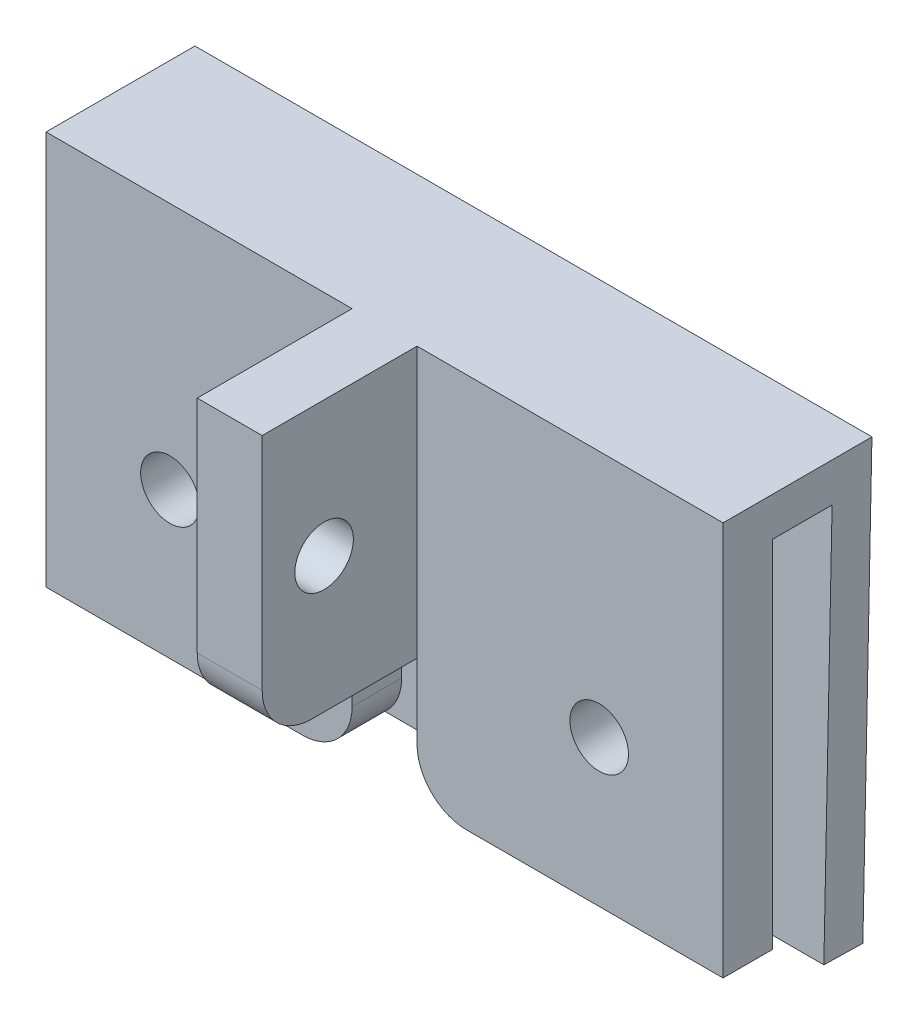
ISO-10303-21;
HEADER;
FILE_DESCRIPTION(('STEP AP214'),'2;1');
FILE_NAME('part.step','',(''),(''),'','','');
FILE_SCHEMA(('AUTOMOTIVE_DESIGN { 1 0 10303 214 1 1 1 1 }'));
ENDSEC;
DATA;
#1=APPLICATION_CONTEXT('core data for automotive mechanical design processes');
#2=APPLICATION_PROTOCOL_DEFINITION('international standard','automotive_design',2000,#1);
#3=PRODUCT_CONTEXT('',#1,'mechanical');
#4=PRODUCT('Part','Part','',(#3));
#5=PRODUCT_RELATED_PRODUCT_CATEGORY('part','',(#4));
#6=PRODUCT_DEFINITION_FORMATION('','',#4);
#7=PRODUCT_DEFINITION_CONTEXT('part definition',#1,'design');
#8=PRODUCT_DEFINITION('design','',#6,#7);
#9=PRODUCT_DEFINITION_SHAPE('','',#8);
#10=(LENGTH_UNIT() NAMED_UNIT(*) SI_UNIT(.MILLI.,.METRE.));
#11=(NAMED_UNIT(*) PLANE_ANGLE_UNIT() SI_UNIT($,.RADIAN.));
#12=(NAMED_UNIT(*) SI_UNIT($,.STERADIAN.) SOLID_ANGLE_UNIT());
#13=UNCERTAINTY_MEASURE_WITH_UNIT(LENGTH_MEASURE(1.E-05),#10,'distance_accuracy_value','');
#14=(GEOMETRIC_REPRESENTATION_CONTEXT(3) GLOBAL_UNCERTAINTY_ASSIGNED_CONTEXT((#13)) GLOBAL_UNIT_ASSIGNED_CONTEXT((#10,
#11,#12)) REPRESENTATION_CONTEXT('',''));
#15=CARTESIAN_POINT('',(0.,0.,0.));
#16=DIRECTION('',(0.,0.,1.));
#17=DIRECTION('',(1.,0.,0.));
#18=AXIS2_PLACEMENT_3D('',#15,#16,#17);
#19=CARTESIAN_POINT('',(0.,0.,2.54));
#20=DIRECTION('',(0.,0.,1.));
#21=DIRECTION('',(1.,0.,0.));
#22=AXIS2_PLACEMENT_3D('',#19,#20,#21);
#23=PLANE('',#22);
#24=DIRECTION('',(1.,0.,0.));
#25=VECTOR('',#24,1.);
#26=CARTESIAN_POINT('',(0.,-10.1019991,2.54));
#27=LINE('',#26,#25);
#28=CARTESIAN_POINT('',(-17.35,-10.1019991,2.54));
#29=VERTEX_POINT('',#28);
#30=CARTESIAN_POINT('',(-4.2037,-10.1019991,2.54));
#31=VERTEX_POINT('',#30);
#32=EDGE_CURVE('E245',#29,#31,#27,.T.);
#33=ORIENTED_EDGE('',*,*,#32,.T.);
#34=CARTESIAN_POINT('',(-4.2037,-7.5619991,2.54));
#35=DIRECTION('',(0.,0.,1.));
#36=DIRECTION('',(1.,0.,0.));
#37=AXIS2_PLACEMENT_3D('',#34,#35,#36);
#38=CIRCLE('',#37,2.54);
#39=CARTESIAN_POINT('',(-1.6637,-7.5619991,2.54));
#40=VERTEX_POINT('',#39);
#41=EDGE_CURVE('E11',#31,#40,#38,.T.);
#42=ORIENTED_EDGE('',*,*,#41,.T.);
#43=DIRECTION('',(0.,1.,0.));
#44=VECTOR('',#43,1.);
#45=CARTESIAN_POINT('',(-1.6637,0.,2.54));
#46=LINE('',#45,#44);
#47=CARTESIAN_POINT('',(-1.6637,-3.7519991,2.54));
#48=VERTEX_POINT('',#47);
#49=EDGE_CURVE('E254',#40,#48,#46,.T.);
#50=ORIENTED_EDGE('',*,*,#49,.T.);
#51=DIRECTION('',(0.,-1.,0.));
#52=VECTOR('',#51,1.);
#53=CARTESIAN_POINT('',(-1.6637,-3.7519991,2.54));
#54=LINE('',#53,#52);
#55=CARTESIAN_POINT('',(-1.6637,10.1019991,2.54));
#56=VERTEX_POINT('',#55);
#57=EDGE_CURVE('E216',#56,#48,#54,.T.);
#58=ORIENTED_EDGE('',*,*,#57,.F.);
#59=DIRECTION('',(1.,0.,0.));
#60=VECTOR('',#59,1.);
#61=CARTESIAN_POINT('',(0.,10.1019991,2.54));
#62=LINE('',#61,#60);
#63=CARTESIAN_POINT('',(-17.35,10.1019991,2.54));
#64=VERTEX_POINT('',#63);
#65=EDGE_CURVE('E249',#64,#56,#62,.T.);
#66=ORIENTED_EDGE('',*,*,#65,.F.);
#67=DIRECTION('',(0.,-1.,0.));
#68=VECTOR('',#67,1.);
#69=CARTESIAN_POINT('',(-17.35,0.,2.54));
#70=LINE('',#69,#68);
#71=EDGE_CURVE('E252',#64,#29,#70,.T.);
#72=ORIENTED_EDGE('',*,*,#71,.T.);
#73=EDGE_LOOP('',(#33,#42,#50,#58,#66,#72));
#74=FACE_BOUND('',#73,.T.);
#75=CARTESIAN_POINT('',(-11.,-2.5980009,2.54));
#76=DIRECTION('',(0.,0.,1.));
#77=DIRECTION('',(1.,0.,0.));
#78=AXIS2_PLACEMENT_3D('',#75,#76,#77);
#79=CIRCLE('',#78,1.5);
#80=CARTESIAN_POINT('',(-9.5,-2.5980009,2.54));
#81=VERTEX_POINT('',#80);
#82=EDGE_CURVE('E235',#81,#81,#79,.T.);
#83=ORIENTED_EDGE('',*,*,#82,.F.);
#84=EDGE_LOOP('',(#83));
#85=FACE_BOUND('',#84,.T.);
#86=ADVANCED_FACE('F37',(#74,#85),#23,.T.);
#87=CARTESIAN_POINT('',(0.,-3.7519991,2.54));
#88=DIRECTION('',(0.,1.,0.));
#89=DIRECTION('',(-1.,0.,0.));
#90=AXIS2_PLACEMENT_3D('',#87,#88,#89);
#91=PLANE('',#90);
#92=DIRECTION('',(0.,0.,-1.));
#93=VECTOR('',#92,1.);
#94=CARTESIAN_POINT('',(1.6637,-3.7519991,10.4775));
#95=LINE('',#94,#93);
#96=CARTESIAN_POINT('',(1.6637,-3.7519991,7.9375));
#97=VERTEX_POINT('',#96);
#98=CARTESIAN_POINT('',(1.6637,-3.7519991,2.54));
#99=VERTEX_POINT('',#98);
#100=EDGE_CURVE('E226',#97,#99,#95,.T.);
#101=ORIENTED_EDGE('',*,*,#100,.F.);
#102=DIRECTION('',(1.,0.,0.));
#103=VECTOR('',#102,1.);
#104=CARTESIAN_POINT('',(0.,-3.7519991,7.9375));
#105=LINE('',#104,#103);
#106=CARTESIAN_POINT('',(-1.6637,-3.7519991,7.9375));
#107=VERTEX_POINT('',#106);
#108=EDGE_CURVE('E299',#97,#107,#105,.F.);
#109=ORIENTED_EDGE('',*,*,#108,.T.);
#110=DIRECTION('',(0.,0.,-1.));
#111=VECTOR('',#110,1.);
#112=CARTESIAN_POINT('',(-1.6637,-3.7519991,10.4775));
#113=LINE('',#112,#111);
#114=EDGE_CURVE('E228',#107,#48,#113,.T.);
#115=ORIENTED_EDGE('',*,*,#114,.T.);
#116=DIRECTION('',(0.,0.,-1.));
#117=VECTOR('',#116,1.);
#118=CARTESIAN_POINT('',(-1.6637,-3.7519991,2.54));
#119=LINE('',#118,#117);
#120=CARTESIAN_POINT('',(-1.6637,-3.7519991,0.));
#121=VERTEX_POINT('',#120);
#122=EDGE_CURVE('E256',#48,#121,#119,.T.);
#123=ORIENTED_EDGE('',*,*,#122,.T.);
#124=DIRECTION('',(1.,0.,0.));
#125=VECTOR('',#124,1.);
#126=CARTESIAN_POINT('',(0.,-3.7519991,0.));
#127=LINE('',#126,#125);
#128=CARTESIAN_POINT('',(1.6637,-3.7519991,0.));
#129=VERTEX_POINT('',#128);
#130=EDGE_CURVE('E262',#121,#129,#127,.T.);
#131=ORIENTED_EDGE('',*,*,#130,.T.);
#132=DIRECTION('',(0.,0.,-1.));
#133=VECTOR('',#132,1.);
#134=CARTESIAN_POINT('',(1.6637,-3.7519991,2.54));
#135=LINE('',#134,#133);
#136=EDGE_CURVE('E289',#99,#129,#135,.T.);
#137=ORIENTED_EDGE('',*,*,#136,.F.);
#138=EDGE_LOOP('',(#101,#109,#115,#123,#131,#137));
#139=FACE_BOUND('',#138,.T.);
#140=ADVANCED_FACE('F332',(#139),#91,.F.);
#141=CARTESIAN_POINT('',(1.6637,0.,2.54));
#142=DIRECTION('',(1.,0.,0.));
#143=DIRECTION('',(0.,1.,0.));
#144=AXIS2_PLACEMENT_3D('',#141,#142,#143);
#145=PLANE('',#144);
#146=DIRECTION('',(0.,-1.,0.));
#147=VECTOR('',#146,1.);
#148=CARTESIAN_POINT('',(1.6637,0.,0.));
#149=LINE('',#148,#147);
#150=CARTESIAN_POINT('',(1.6637,-7.5619991,0.));
#151=VERTEX_POINT('',#150);
#152=EDGE_CURVE('E265',#129,#151,#149,.T.);
#153=ORIENTED_EDGE('',*,*,#152,.T.);
#154=DIRECTION('',(0.,0.,-1.));
#155=VECTOR('',#154,1.);
#156=CARTESIAN_POINT('',(1.6637,-7.5619991,2.54));
#157=LINE('',#156,#155);
#158=CARTESIAN_POINT('',(1.6637,-7.5619991,2.54));
#159=VERTEX_POINT('',#158);
#160=EDGE_CURVE('E310',#151,#159,#157,.F.);
#161=ORIENTED_EDGE('',*,*,#160,.T.);
#162=DIRECTION('',(0.,-1.,0.));
#163=VECTOR('',#162,1.);
#164=CARTESIAN_POINT('',(1.6637,0.,2.54));
#165=LINE('',#164,#163);
#166=EDGE_CURVE('E239',#99,#159,#165,.T.);
#167=ORIENTED_EDGE('',*,*,#166,.F.);
#168=ORIENTED_EDGE('',*,*,#136,.T.);
#169=EDGE_LOOP('',(#153,#161,#167,#168));
#170=FACE_BOUND('',#169,.T.);
#171=ADVANCED_FACE('F367',(#170),#145,.F.);
#172=CARTESIAN_POINT('',(0.,-10.1019991,2.54));
#173=DIRECTION('',(0.,1.,0.));
#174=DIRECTION('',(-1.,0.,0.));
#175=AXIS2_PLACEMENT_3D('',#172,#173,#174);
#176=PLANE('',#175);
#177=CARTESIAN_POINT('',(4.2037,-10.1019991,2.54));
#178=VERTEX_POINT('',#177);
#179=CARTESIAN_POINT('',(17.35,-10.1019991,2.54));
#180=VERTEX_POINT('',#179);
#181=EDGE_CURVE('E242',#178,#180,#27,.T.);
#182=ORIENTED_EDGE('',*,*,#181,.F.);
#183=DIRECTION('',(0.,0.,-1.));
#184=VECTOR('',#183,1.);
#185=CARTESIAN_POINT('',(4.2037,-10.1019991,2.54));
#186=LINE('',#185,#184);
#187=CARTESIAN_POINT('',(4.2037,-10.1019991,0.));
#188=VERTEX_POINT('',#187);
#189=EDGE_CURVE('E303',#178,#188,#186,.T.);
#190=ORIENTED_EDGE('',*,*,#189,.T.);
#191=DIRECTION('',(1.,0.,0.));
#192=VECTOR('',#191,1.);
#193=CARTESIAN_POINT('',(0.,-10.1019991,0.));
#194=LINE('',#193,#192);
#195=CARTESIAN_POINT('',(17.35,-10.1019991,0.));
#196=VERTEX_POINT('',#195);
#197=EDGE_CURVE('E268',#188,#196,#194,.T.);
#198=ORIENTED_EDGE('',*,*,#197,.T.);
#199=DIRECTION('',(0.,0.,-1.));
#200=VECTOR('',#199,1.);
#201=CARTESIAN_POINT('',(17.35,-10.1019991,2.54));
#202=LINE('',#201,#200);
#203=EDGE_CURVE('E286',#180,#196,#202,.T.);
#204=ORIENTED_EDGE('',*,*,#203,.F.);
#205=EDGE_LOOP('',(#182,#190,#198,#204));
#206=FACE_BOUND('',#205,.T.);
#207=ADVANCED_FACE('F402',(#206),#176,.F.);
#208=CARTESIAN_POINT('',(17.35,0.,2.54));
#209=DIRECTION('',(1.,0.,0.));
#210=DIRECTION('',(0.,0.,-1.));
#211=AXIS2_PLACEMENT_3D('',#208,#209,#210);
#212=PLANE('',#211);
#213=DIRECTION('',(0.,-1.,0.));
#214=VECTOR('',#213,1.);
#215=CARTESIAN_POINT('',(17.35,0.,0.));
#216=LINE('',#215,#214);
#217=CARTESIAN_POINT('',(17.35,8.1019991,0.));
#218=VERTEX_POINT('',#217);
#219=EDGE_CURVE('E271',#218,#196,#216,.T.);
#220=ORIENTED_EDGE('',*,*,#219,.F.);
#221=DIRECTION('',(0.,0.,1.));
#222=VECTOR('',#221,1.);
#223=CARTESIAN_POINT('',(17.35,8.1019991,0.));
#224=LINE('',#223,#222);
#225=CARTESIAN_POINT('',(17.35,8.1019991,-3.048));
#226=VERTEX_POINT('',#225);
#227=EDGE_CURVE('E52',#226,#218,#224,.T.);
#228=ORIENTED_EDGE('',*,*,#227,.F.);
#229=DIRECTION('',(0.,0.999781050611338,-0.0209248856266598));
#230=VECTOR('',#229,1.);
#231=CARTESIAN_POINT('',(17.35,-0.0602176199063773,-2.87716914536476));
#232=LINE('',#231,#230);
#233=CARTESIAN_POINT('',(17.35,-12.1015612012227,-2.62515022874668));
#234=VERTEX_POINT('',#233);
#235=EDGE_CURVE('E169',#234,#226,#232,.T.);
#236=ORIENTED_EDGE('',*,*,#235,.F.);
#237=DIRECTION('',(0.,0.0209248856266599,0.999781050611338));
#238=VECTOR('',#237,1.);
#239=CARTESIAN_POINT('',(17.35,-12.0413435813163,0.252018916618084));
#240=LINE('',#239,#238);
#241=CARTESIAN_POINT('',(17.35,-12.143410972476,-4.62471232996936));
#242=VERTEX_POINT('',#241);
#243=EDGE_CURVE('E176',#242,#234,#240,.T.);
#244=ORIENTED_EDGE('',*,*,#243,.F.);
#245=DIRECTION('',(0.,-0.999781050611338,0.0209248856266591));
#246=VECTOR('',#245,1.);
#247=CARTESIAN_POINT('',(17.35,-0.102067391159693,-4.87673124658743));
#248=LINE('',#247,#246);
#249=CARTESIAN_POINT('',(17.35,10.1019991,-5.09029693091781));
#250=VERTEX_POINT('',#249);
#251=EDGE_CURVE('E182',#250,#242,#248,.T.);
#252=ORIENTED_EDGE('',*,*,#251,.F.);
#253=DIRECTION('',(0.,0.,-1.));
#254=VECTOR('',#253,1.);
#255=CARTESIAN_POINT('',(17.35,10.1019991,2.54));
#256=LINE('',#255,#254);
#257=CARTESIAN_POINT('',(17.35,10.1019991,2.54));
#258=VERTEX_POINT('',#257);
#259=EDGE_CURVE('E284',#258,#250,#256,.T.);
#260=ORIENTED_EDGE('',*,*,#259,.F.);
#261=DIRECTION('',(0.,-1.,0.));
#262=VECTOR('',#261,1.);
#263=CARTESIAN_POINT('',(17.35,0.,2.54));
#264=LINE('',#263,#262);
#265=EDGE_CURVE('E244',#258,#180,#264,.T.);
#266=ORIENTED_EDGE('',*,*,#265,.T.);
#267=ORIENTED_EDGE('',*,*,#203,.T.);
#268=EDGE_LOOP('',(#220,#228,#236,#244,#252,#260,#266,#267));
#269=FACE_BOUND('',#268,.T.);
#270=ADVANCED_FACE('F185',(#269),#212,.T.);
#271=CARTESIAN_POINT('',(0.,10.1019991,2.54));
#272=DIRECTION('',(0.,1.,0.));
#273=DIRECTION('',(-1.,0.,0.));
#274=AXIS2_PLACEMENT_3D('',#271,#272,#273);
#275=PLANE('',#274);
#276=ORIENTED_EDGE('',*,*,#259,.T.);
#277=DIRECTION('',(1.,0.,0.));
#278=VECTOR('',#277,1.);
#279=CARTESIAN_POINT('',(-40.1703723049719,10.1019991,-5.09029693091781));
#280=LINE('',#279,#278);
#281=CARTESIAN_POINT('',(-17.35,10.1019991,-5.0902969309178));
#282=VERTEX_POINT('',#281);
#283=EDGE_CURVE('E197',#282,#250,#280,.T.);
#284=ORIENTED_EDGE('',*,*,#283,.F.);
#285=DIRECTION('',(0.,0.,-1.));
#286=VECTOR('',#285,1.);
#287=CARTESIAN_POINT('',(-17.35,10.1019991,2.54));
#288=LINE('',#287,#286);
#289=EDGE_CURVE('E282',#64,#282,#288,.T.);
#290=ORIENTED_EDGE('',*,*,#289,.F.);
#291=ORIENTED_EDGE('',*,*,#65,.T.);
#292=DIRECTION('',(0.,0.,-1.));
#293=VECTOR('',#292,1.);
#294=CARTESIAN_POINT('',(-1.6637,10.1019991,10.4775));
#295=LINE('',#294,#293);
#296=CARTESIAN_POINT('',(-1.6637,10.1019991,10.4775));
#297=VERTEX_POINT('',#296);
#298=EDGE_CURVE('E215',#297,#56,#295,.T.);
#299=ORIENTED_EDGE('',*,*,#298,.F.);
#300=DIRECTION('',(-1.,0.,0.));
#301=VECTOR('',#300,1.);
#302=CARTESIAN_POINT('',(-1.6637,10.1019991,10.4775));
#303=LINE('',#302,#301);
#304=CARTESIAN_POINT('',(1.6637,10.1019991,10.4775));
#305=VERTEX_POINT('',#304);
#306=EDGE_CURVE('E213',#305,#297,#303,.T.);
#307=ORIENTED_EDGE('',*,*,#306,.F.);
#308=DIRECTION('',(0.,0.,-1.));
#309=VECTOR('',#308,1.);
#310=CARTESIAN_POINT('',(1.6637,10.1019991,10.4775));
#311=LINE('',#310,#309);
#312=CARTESIAN_POINT('',(1.6637,10.1019991,2.54));
#313=VERTEX_POINT('',#312);
#314=EDGE_CURVE('E223',#305,#313,#311,.T.);
#315=ORIENTED_EDGE('',*,*,#314,.T.);
#316=EDGE_CURVE('E248',#313,#258,#62,.T.);
#317=ORIENTED_EDGE('',*,*,#316,.T.);
#318=EDGE_LOOP('',(#276,#284,#290,#291,#299,#307,#315,#317));
#319=FACE_BOUND('',#318,.T.);
#320=ADVANCED_FACE('F343',(#319),#275,.T.);
#321=CARTESIAN_POINT('',(-17.35,0.,2.54));
#322=DIRECTION('',(1.,0.,0.));
#323=DIRECTION('',(0.,0.,-1.));
#324=AXIS2_PLACEMENT_3D('',#321,#322,#323);
#325=PLANE('',#324);
#326=ORIENTED_EDGE('',*,*,#289,.T.);
#327=DIRECTION('',(0.,0.999781050611338,-0.0209248856266591));
#328=VECTOR('',#327,1.);
#329=CARTESIAN_POINT('',(-17.35,-0.102067391159693,-4.87673124658743));
#330=LINE('',#329,#328);
#331=CARTESIAN_POINT('',(-17.35,-12.143410972476,-4.62471232996936));
#332=VERTEX_POINT('',#331);
#333=EDGE_CURVE('E202',#332,#282,#330,.T.);
#334=ORIENTED_EDGE('',*,*,#333,.F.);
#335=DIRECTION('',(0.,-0.0209248856266599,-0.999781050611338));
#336=VECTOR('',#335,1.);
#337=CARTESIAN_POINT('',(-17.35,-12.0413435813163,0.252018916618084));
#338=LINE('',#337,#336);
#339=CARTESIAN_POINT('',(-17.35,-12.1015612012227,-2.62515022874668));
#340=VERTEX_POINT('',#339);
#341=EDGE_CURVE('E194',#340,#332,#338,.T.);
#342=ORIENTED_EDGE('',*,*,#341,.F.);
#343=DIRECTION('',(0.,-0.999781050611338,0.0209248856266598));
#344=VECTOR('',#343,1.);
#345=CARTESIAN_POINT('',(-17.35,-0.0602176199063773,-2.87716914536476));
#346=LINE('',#345,#344);
#347=CARTESIAN_POINT('',(-17.35,8.1019991,-3.048));
#348=VERTEX_POINT('',#347);
#349=EDGE_CURVE('E170',#348,#340,#346,.T.);
#350=ORIENTED_EDGE('',*,*,#349,.F.);
#351=DIRECTION('',(0.,0.,-1.));
#352=VECTOR('',#351,1.);
#353=CARTESIAN_POINT('',(-17.35,8.1019991,0.));
#354=LINE('',#353,#352);
#355=CARTESIAN_POINT('',(-17.35,8.1019991,0.));
#356=VERTEX_POINT('',#355);
#357=EDGE_CURVE('E431',#356,#348,#354,.T.);
#358=ORIENTED_EDGE('',*,*,#357,.F.);
#359=DIRECTION('',(0.,-1.,0.));
#360=VECTOR('',#359,1.);
#361=CARTESIAN_POINT('',(-17.35,0.,0.));
#362=LINE('',#361,#360);
#363=CARTESIAN_POINT('',(-17.35,-10.1019991,0.));
#364=VERTEX_POINT('',#363);
#365=EDGE_CURVE('E274',#356,#364,#362,.T.);
#366=ORIENTED_EDGE('',*,*,#365,.T.);
#367=DIRECTION('',(0.,0.,-1.));
#368=VECTOR('',#367,1.);
#369=CARTESIAN_POINT('',(-17.35,-10.1019991,2.54));
#370=LINE('',#369,#368);
#371=EDGE_CURVE('E279',#29,#364,#370,.T.);
#372=ORIENTED_EDGE('',*,*,#371,.F.);
#373=ORIENTED_EDGE('',*,*,#71,.F.);
#374=EDGE_LOOP('',(#326,#334,#342,#350,#358,#366,#372,#373));
#375=FACE_BOUND('',#374,.T.);
#376=ADVANCED_FACE('F350',(#375),#325,.F.);
#377=CARTESIAN_POINT('',(-4.2037,-10.1019991,0.));
#378=VERTEX_POINT('',#377);
#379=EDGE_CURVE('E272',#364,#378,#194,.T.);
#380=ORIENTED_EDGE('',*,*,#379,.T.);
#381=DIRECTION('',(0.,0.,-1.));
#382=VECTOR('',#381,1.);
#383=CARTESIAN_POINT('',(-4.2037,-10.1019991,2.54));
#384=LINE('',#383,#382);
#385=EDGE_CURVE('E45',#378,#31,#384,.F.);
#386=ORIENTED_EDGE('',*,*,#385,.T.);
#387=ORIENTED_EDGE('',*,*,#32,.F.);
#388=ORIENTED_EDGE('',*,*,#371,.T.);
#389=EDGE_LOOP('',(#380,#386,#387,#388));
#390=FACE_BOUND('',#389,.T.);
#391=ADVANCED_FACE('F395',(#390),#176,.F.);
#392=CARTESIAN_POINT('',(-11.,-2.5980009,2.54));
#393=DIRECTION('',(0.,0.,-1.));
#394=DIRECTION('',(-1.,0.,0.));
#395=AXIS2_PLACEMENT_3D('',#392,#393,#394);
#396=CYLINDRICAL_SURFACE('',#395,1.5);
#397=ORIENTED_EDGE('',*,*,#82,.T.);
#398=EDGE_LOOP('',(#397));
#399=FACE_BOUND('',#398,.T.);
#400=CARTESIAN_POINT('',(-11.,-2.5980009,0.));
#401=DIRECTION('',(0.,0.,1.));
#402=DIRECTION('',(1.,0.,0.));
#403=AXIS2_PLACEMENT_3D('',#400,#401,#402);
#404=CIRCLE('',#403,1.5);
#405=CARTESIAN_POINT('',(-9.5,-2.5980009,0.));
#406=VERTEX_POINT('',#405);
#407=EDGE_CURVE('E259',#406,#406,#404,.T.);
#408=ORIENTED_EDGE('',*,*,#407,.F.);
#409=EDGE_LOOP('',(#408));
#410=FACE_BOUND('',#409,.T.);
#411=ADVANCED_FACE('F388',(#399,#410),#396,.F.);
#412=CARTESIAN_POINT('',(11.,-2.5980009,2.54));
#413=DIRECTION('',(0.,0.,-1.));
#414=DIRECTION('',(-1.,0.,0.));
#415=AXIS2_PLACEMENT_3D('',#412,#413,#414);
#416=CYLINDRICAL_SURFACE('',#415,1.5);
#417=CARTESIAN_POINT('',(11.,-2.5980009,2.54));
#418=DIRECTION('',(0.,0.,1.));
#419=DIRECTION('',(1.,0.,0.));
#420=AXIS2_PLACEMENT_3D('',#417,#418,#419);
#421=CIRCLE('',#420,1.5);
#422=CARTESIAN_POINT('',(12.5,-2.5980009,2.54));
#423=VERTEX_POINT('',#422);
#424=EDGE_CURVE('E232',#423,#423,#421,.T.);
#425=ORIENTED_EDGE('',*,*,#424,.T.);
#426=EDGE_LOOP('',(#425));
#427=FACE_BOUND('',#426,.T.);
#428=CARTESIAN_POINT('',(11.,-2.5980009,0.));
#429=DIRECTION('',(0.,0.,1.));
#430=DIRECTION('',(1.,0.,0.));
#431=AXIS2_PLACEMENT_3D('',#428,#429,#430);
#432=CIRCLE('',#431,1.5);
#433=CARTESIAN_POINT('',(12.5,-2.5980009,0.));
#434=VERTEX_POINT('',#433);
#435=EDGE_CURVE('E231',#434,#434,#432,.T.);
#436=ORIENTED_EDGE('',*,*,#435,.F.);
#437=EDGE_LOOP('',(#436));
#438=FACE_BOUND('',#437,.T.);
#439=ADVANCED_FACE('F378',(#427,#438),#416,.F.);
#440=CARTESIAN_POINT('',(-1.6637,0.,2.54));
#441=DIRECTION('',(-1.,0.,0.));
#442=DIRECTION('',(0.,0.,1.));
#443=AXIS2_PLACEMENT_3D('',#440,#441,#442);
#444=PLANE('',#443);
#445=ORIENTED_EDGE('',*,*,#49,.F.);
#446=DIRECTION('',(0.,0.,-1.));
#447=VECTOR('',#446,1.);
#448=CARTESIAN_POINT('',(-1.6637,-7.5619991,2.54));
#449=LINE('',#448,#447);
#450=CARTESIAN_POINT('',(-1.6637,-7.5619991,0.));
#451=VERTEX_POINT('',#450);
#452=EDGE_CURVE('E314',#40,#451,#449,.T.);
#453=ORIENTED_EDGE('',*,*,#452,.T.);
#454=DIRECTION('',(0.,1.,0.));
#455=VECTOR('',#454,1.);
#456=CARTESIAN_POINT('',(-1.6637,0.,0.));
#457=LINE('',#456,#455);
#458=EDGE_CURVE('E236',#451,#121,#457,.T.);
#459=ORIENTED_EDGE('',*,*,#458,.T.);
#460=ORIENTED_EDGE('',*,*,#122,.F.);
#461=EDGE_LOOP('',(#445,#453,#459,#460));
#462=FACE_BOUND('',#461,.T.);
#463=ADVANCED_FACE('F320',(#462),#444,.F.);
#464=ORIENTED_EDGE('',*,*,#166,.T.);
#465=CARTESIAN_POINT('',(4.2037,-7.5619991,2.54));
#466=DIRECTION('',(0.,0.,1.));
#467=DIRECTION('',(1.,0.,0.));
#468=AXIS2_PLACEMENT_3D('',#465,#466,#467);
#469=CIRCLE('',#468,2.54);
#470=EDGE_CURVE('E312',#159,#178,#469,.T.);
#471=ORIENTED_EDGE('',*,*,#470,.T.);
#472=ORIENTED_EDGE('',*,*,#181,.T.);
#473=ORIENTED_EDGE('',*,*,#265,.F.);
#474=ORIENTED_EDGE('',*,*,#316,.F.);
#475=DIRECTION('',(0.,1.,0.));
#476=VECTOR('',#475,1.);
#477=CARTESIAN_POINT('',(1.6637,-3.7519991,2.54));
#478=LINE('',#477,#476);
#479=EDGE_CURVE('E211',#99,#313,#478,.T.);
#480=ORIENTED_EDGE('',*,*,#479,.F.);
#481=EDGE_LOOP('',(#464,#471,#472,#473,#474,#480));
#482=FACE_BOUND('',#481,.T.);
#483=ORIENTED_EDGE('',*,*,#424,.F.);
#484=EDGE_LOOP('',(#483));
#485=FACE_BOUND('',#484,.T.);
#486=ADVANCED_FACE('F363',(#482,#485),#23,.T.);
#487=CARTESIAN_POINT('',(0.,0.,0.));
#488=DIRECTION('',(0.,0.,1.));
#489=DIRECTION('',(1.,0.,0.));
#490=AXIS2_PLACEMENT_3D('',#487,#488,#489);
#491=PLANE('',#490);
#492=ORIENTED_EDGE('',*,*,#435,.T.);
#493=EDGE_LOOP('',(#492));
#494=FACE_BOUND('',#493,.T.);
#495=ORIENTED_EDGE('',*,*,#407,.T.);
#496=EDGE_LOOP('',(#495));
#497=FACE_BOUND('',#496,.T.);
#498=ORIENTED_EDGE('',*,*,#365,.F.);
#499=DIRECTION('',(1.,0.,0.));
#500=VECTOR('',#499,1.);
#501=CARTESIAN_POINT('',(-40.1703723049719,8.1019991,0.));
#502=LINE('',#501,#500);
#503=EDGE_CURVE('E195',#356,#218,#502,.T.);
#504=ORIENTED_EDGE('',*,*,#503,.T.);
#505=ORIENTED_EDGE('',*,*,#219,.T.);
#506=ORIENTED_EDGE('',*,*,#197,.F.);
#507=CARTESIAN_POINT('',(4.2037,-7.5619991,0.));
#508=DIRECTION('',(0.,0.,1.));
#509=DIRECTION('',(1.,0.,0.));
#510=AXIS2_PLACEMENT_3D('',#507,#508,#509);
#511=CIRCLE('',#510,2.54);
#512=EDGE_CURVE('E308',#188,#151,#511,.F.);
#513=ORIENTED_EDGE('',*,*,#512,.T.);
#514=ORIENTED_EDGE('',*,*,#152,.F.);
#515=ORIENTED_EDGE('',*,*,#130,.F.);
#516=ORIENTED_EDGE('',*,*,#458,.F.);
#517=CARTESIAN_POINT('',(-4.2037,-7.5619991,0.));
#518=DIRECTION('',(0.,0.,1.));
#519=DIRECTION('',(1.,0.,0.));
#520=AXIS2_PLACEMENT_3D('',#517,#518,#519);
#521=CIRCLE('',#520,2.54);
#522=EDGE_CURVE('E306',#451,#378,#521,.F.);
#523=ORIENTED_EDGE('',*,*,#522,.T.);
#524=ORIENTED_EDGE('',*,*,#379,.F.);
#525=EDGE_LOOP('',(#498,#504,#505,#506,#513,#514,#515,#516,#523,#524));
#526=FACE_BOUND('',#525,.T.);
#527=ADVANCED_FACE('F327',(#494,#497,#526),#491,.F.);
#528=CARTESIAN_POINT('',(-1.6637,-3.7519991,10.4775));
#529=DIRECTION('',(1.,0.,0.));
#530=DIRECTION('',(0.,0.,-1.));
#531=AXIS2_PLACEMENT_3D('',#528,#529,#530);
#532=PLANE('',#531);
#533=CARTESIAN_POINT('',(-1.6637,3.175,7.3025));
#534=DIRECTION('',(-1.,0.,0.));
#535=DIRECTION('',(0.,0.,1.));
#536=AXIS2_PLACEMENT_3D('',#533,#534,#535);
#537=CIRCLE('',#536,1.5);
#538=CARTESIAN_POINT('',(-1.6637,3.175,8.8025));
#539=VERTEX_POINT('',#538);
#540=EDGE_CURVE('E203',#539,#539,#537,.T.);
#541=ORIENTED_EDGE('',*,*,#540,.F.);
#542=EDGE_LOOP('',(#541));
#543=FACE_BOUND('',#542,.T.);
#544=ORIENTED_EDGE('',*,*,#114,.F.);
#545=CARTESIAN_POINT('',(-1.6637,-1.2119991,7.9375));
#546=DIRECTION('',(1.,0.,0.));
#547=DIRECTION('',(0.,0.,-1.));
#548=AXIS2_PLACEMENT_3D('',#545,#546,#547);
#549=CIRCLE('',#548,2.54);
#550=CARTESIAN_POINT('',(-1.6637,-1.2119991,10.4775));
#551=VERTEX_POINT('',#550);
#552=EDGE_CURVE('E301',#107,#551,#549,.F.);
#553=ORIENTED_EDGE('',*,*,#552,.T.);
#554=DIRECTION('',(0.,-1.,0.));
#555=VECTOR('',#554,1.);
#556=CARTESIAN_POINT('',(-1.6637,-3.7519991,10.4775));
#557=LINE('',#556,#555);
#558=EDGE_CURVE('E207',#297,#551,#557,.T.);
#559=ORIENTED_EDGE('',*,*,#558,.F.);
#560=ORIENTED_EDGE('',*,*,#298,.T.);
#561=ORIENTED_EDGE('',*,*,#57,.T.);
#562=EDGE_LOOP('',(#544,#553,#559,#560,#561));
#563=FACE_BOUND('',#562,.T.);
#564=ADVANCED_FACE('F335',(#543,#563),#532,.F.);
#565=CARTESIAN_POINT('',(1.6637,-3.7519991,10.4775));
#566=DIRECTION('',(-1.,0.,0.));
#567=DIRECTION('',(0.,-1.,0.));
#568=AXIS2_PLACEMENT_3D('',#565,#566,#567);
#569=PLANE('',#568);
#570=CARTESIAN_POINT('',(1.6637,3.175,7.3025));
#571=DIRECTION('',(-1.,0.,0.));
#572=DIRECTION('',(0.,-1.,0.));
#573=AXIS2_PLACEMENT_3D('',#570,#571,#572);
#574=CIRCLE('',#573,1.5);
#575=CARTESIAN_POINT('',(1.6637,1.675,7.3025));
#576=VERTEX_POINT('',#575);
#577=EDGE_CURVE('E206',#576,#576,#574,.T.);
#578=ORIENTED_EDGE('',*,*,#577,.T.);
#579=EDGE_LOOP('',(#578));
#580=FACE_BOUND('',#579,.T.);
#581=DIRECTION('',(0.,1.,0.));
#582=VECTOR('',#581,1.);
#583=CARTESIAN_POINT('',(1.6637,-3.7519991,10.4775));
#584=LINE('',#583,#582);
#585=CARTESIAN_POINT('',(1.6637,-1.2119991,10.4775));
#586=VERTEX_POINT('',#585);
#587=EDGE_CURVE('E210',#586,#305,#584,.T.);
#588=ORIENTED_EDGE('',*,*,#587,.F.);
#589=CARTESIAN_POINT('',(1.6637,-1.2119991,7.9375));
#590=DIRECTION('',(-1.,0.,0.));
#591=DIRECTION('',(0.,-1.,0.));
#592=AXIS2_PLACEMENT_3D('',#589,#590,#591);
#593=CIRCLE('',#592,2.54);
#594=EDGE_CURVE('E297',#586,#97,#593,.F.);
#595=ORIENTED_EDGE('',*,*,#594,.T.);
#596=ORIENTED_EDGE('',*,*,#100,.T.);
#597=ORIENTED_EDGE('',*,*,#479,.T.);
#598=ORIENTED_EDGE('',*,*,#314,.F.);
#599=EDGE_LOOP('',(#588,#595,#596,#597,#598));
#600=FACE_BOUND('',#599,.T.);
#601=ADVANCED_FACE('F421',(#580,#600),#569,.F.);
#602=CARTESIAN_POINT('',(0.,0.,10.4775));
#603=DIRECTION('',(0.,0.,-1.));
#604=DIRECTION('',(-1.,0.,0.));
#605=AXIS2_PLACEMENT_3D('',#602,#603,#604);
#606=PLANE('',#605);
#607=ORIENTED_EDGE('',*,*,#558,.T.);
#608=DIRECTION('',(1.,0.,0.));
#609=VECTOR('',#608,1.);
#610=CARTESIAN_POINT('',(0.,-1.2119991,10.4775));
#611=LINE('',#610,#609);
#612=EDGE_CURVE('E292',#551,#586,#611,.T.);
#613=ORIENTED_EDGE('',*,*,#612,.T.);
#614=ORIENTED_EDGE('',*,*,#587,.T.);
#615=ORIENTED_EDGE('',*,*,#306,.T.);
#616=EDGE_LOOP('',(#607,#613,#614,#615));
#617=FACE_BOUND('',#616,.T.);
#618=ADVANCED_FACE('F411',(#617),#606,.F.);
#619=CARTESIAN_POINT('',(17.35,3.175,7.3025));
#620=DIRECTION('',(-1.,0.,0.));
#621=DIRECTION('',(0.,0.,1.));
#622=AXIS2_PLACEMENT_3D('',#619,#620,#621);
#623=CYLINDRICAL_SURFACE('',#622,1.5);
#624=ORIENTED_EDGE('',*,*,#540,.T.);
#625=EDGE_LOOP('',(#624));
#626=FACE_BOUND('',#625,.T.);
#627=ORIENTED_EDGE('',*,*,#577,.F.);
#628=EDGE_LOOP('',(#627));
#629=FACE_BOUND('',#628,.T.);
#630=ADVANCED_FACE('F406',(#626,#629),#623,.F.);
#631=CARTESIAN_POINT('',(0.,-1.2119991,7.9375));
#632=DIRECTION('',(1.,0.,0.));
#633=DIRECTION('',(0.,1.,0.));
#634=AXIS2_PLACEMENT_3D('',#631,#632,#633);
#635=CYLINDRICAL_SURFACE('',#634,2.54);
#636=ORIENTED_EDGE('',*,*,#552,.F.);
#637=ORIENTED_EDGE('',*,*,#108,.F.);
#638=ORIENTED_EDGE('',*,*,#594,.F.);
#639=ORIENTED_EDGE('',*,*,#612,.F.);
#640=EDGE_LOOP('',(#636,#637,#638,#639));
#641=FACE_BOUND('',#640,.T.);
#642=ADVANCED_FACE('F359',(#641),#635,.T.);
#643=CARTESIAN_POINT('',(4.2037,-7.5619991,2.54));
#644=DIRECTION('',(0.,0.,-1.));
#645=DIRECTION('',(-1.,0.,0.));
#646=AXIS2_PLACEMENT_3D('',#643,#644,#645);
#647=CYLINDRICAL_SURFACE('',#646,2.54);
#648=ORIENTED_EDGE('',*,*,#470,.F.);
#649=ORIENTED_EDGE('',*,*,#160,.F.);
#650=ORIENTED_EDGE('',*,*,#512,.F.);
#651=ORIENTED_EDGE('',*,*,#189,.F.);
#652=EDGE_LOOP('',(#648,#649,#650,#651));
#653=FACE_BOUND('',#652,.T.);
#654=ADVANCED_FACE('F352',(#653),#647,.T.);
#655=CARTESIAN_POINT('',(-4.2037,-7.5619991,2.54));
#656=DIRECTION('',(0.,0.,-1.));
#657=DIRECTION('',(-1.,0.,0.));
#658=AXIS2_PLACEMENT_3D('',#655,#656,#657);
#659=CYLINDRICAL_SURFACE('',#658,2.54);
#660=ORIENTED_EDGE('',*,*,#41,.F.);
#661=ORIENTED_EDGE('',*,*,#385,.F.);
#662=ORIENTED_EDGE('',*,*,#522,.F.);
#663=ORIENTED_EDGE('',*,*,#452,.F.);
#664=EDGE_LOOP('',(#660,#661,#662,#663));
#665=FACE_BOUND('',#664,.T.);
#666=ADVANCED_FACE('F39',(#665),#659,.T.);
#667=CARTESIAN_POINT('',(-40.1703723049719,-12.0413435813163,0.252018916618084));
#668=DIRECTION('',(0.,0.999781050611338,-0.0209248856266599));
#669=DIRECTION('',(0.,0.0209248856266599,0.999781050611338));
#670=AXIS2_PLACEMENT_3D('',#667,#668,#669);
#671=PLANE('',#670);
#672=DIRECTION('',(1.,0.,0.));
#673=VECTOR('',#672,1.);
#674=CARTESIAN_POINT('',(-40.1703723049719,-12.1015612012227,-2.62515022874668));
#675=LINE('',#674,#673);
#676=EDGE_CURVE('E164',#340,#234,#675,.T.);
#677=ORIENTED_EDGE('',*,*,#676,.F.);
#678=ORIENTED_EDGE('',*,*,#341,.T.);
#679=DIRECTION('',(1.,0.,0.));
#680=VECTOR('',#679,1.);
#681=CARTESIAN_POINT('',(-40.1703723049719,-12.143410972476,-4.62471232996936));
#682=LINE('',#681,#680);
#683=EDGE_CURVE('E173',#332,#242,#682,.T.);
#684=ORIENTED_EDGE('',*,*,#683,.T.);
#685=ORIENTED_EDGE('',*,*,#243,.T.);
#686=EDGE_LOOP('',(#677,#678,#684,#685));
#687=FACE_BOUND('',#686,.T.);
#688=ADVANCED_FACE('F177',(#687),#671,.F.);
#689=CARTESIAN_POINT('',(-40.1703723049719,-0.102067391159693,-4.87673124658743));
#690=DIRECTION('',(0.,0.0209248856266591,0.999781050611338));
#691=DIRECTION('',(0.,-0.999781050611338,0.0209248856266591));
#692=AXIS2_PLACEMENT_3D('',#689,#690,#691);
#693=PLANE('',#692);
#694=ORIENTED_EDGE('',*,*,#683,.F.);
#695=ORIENTED_EDGE('',*,*,#333,.T.);
#696=ORIENTED_EDGE('',*,*,#283,.T.);
#697=ORIENTED_EDGE('',*,*,#251,.T.);
#698=EDGE_LOOP('',(#694,#695,#696,#697));
#699=FACE_BOUND('',#698,.T.);
#700=ADVANCED_FACE('F357',(#699),#693,.F.);
#701=CARTESIAN_POINT('',(-40.1703723049719,8.1019991,0.));
#702=DIRECTION('',(0.,1.,0.));
#703=DIRECTION('',(0.,0.,1.));
#704=AXIS2_PLACEMENT_3D('',#701,#702,#703);
#705=PLANE('',#704);
#706=ORIENTED_EDGE('',*,*,#503,.F.);
#707=ORIENTED_EDGE('',*,*,#357,.T.);
#708=DIRECTION('',(1.,0.,0.));
#709=VECTOR('',#708,1.);
#710=CARTESIAN_POINT('',(-40.1703723049719,8.1019991,-3.048));
#711=LINE('',#710,#709);
#712=EDGE_CURVE('E192',#348,#226,#711,.T.);
#713=ORIENTED_EDGE('',*,*,#712,.T.);
#714=ORIENTED_EDGE('',*,*,#227,.T.);
#715=EDGE_LOOP('',(#706,#707,#713,#714));
#716=FACE_BOUND('',#715,.T.);
#717=ADVANCED_FACE('F434',(#716),#705,.F.);
#718=CARTESIAN_POINT('',(-40.1703723049719,-0.0602176199063773,-2.87716914536476));
#719=DIRECTION('',(0.,-0.0209248856266598,-0.999781050611338));
#720=DIRECTION('',(0.,0.999781050611338,-0.0209248856266598));
#721=AXIS2_PLACEMENT_3D('',#718,#719,#720);
#722=PLANE('',#721);
#723=ORIENTED_EDGE('',*,*,#712,.F.);
#724=ORIENTED_EDGE('',*,*,#349,.T.);
#725=ORIENTED_EDGE('',*,*,#676,.T.);
#726=ORIENTED_EDGE('',*,*,#235,.T.);
#727=EDGE_LOOP('',(#723,#724,#725,#726));
#728=FACE_BOUND('',#727,.T.);
#729=ADVANCED_FACE('F167',(#728),#722,.F.);
#730=CLOSED_SHELL('',(#86,#140,#171,#207,#270,#320,#376,#391,#411,#439,#463,#486,#527,#564,#601,
#618,#630,#642,#654,#666,#688,#700,#717,#729));
#731=MANIFOLD_SOLID_BREP('B2',#730);
#732=ADVANCED_BREP_SHAPE_REPRESENTATION('',(#18,#731),#14);
#733=SHAPE_DEFINITION_REPRESENTATION(#9,#732);
ENDSEC;
END-ISO-10303-21;
